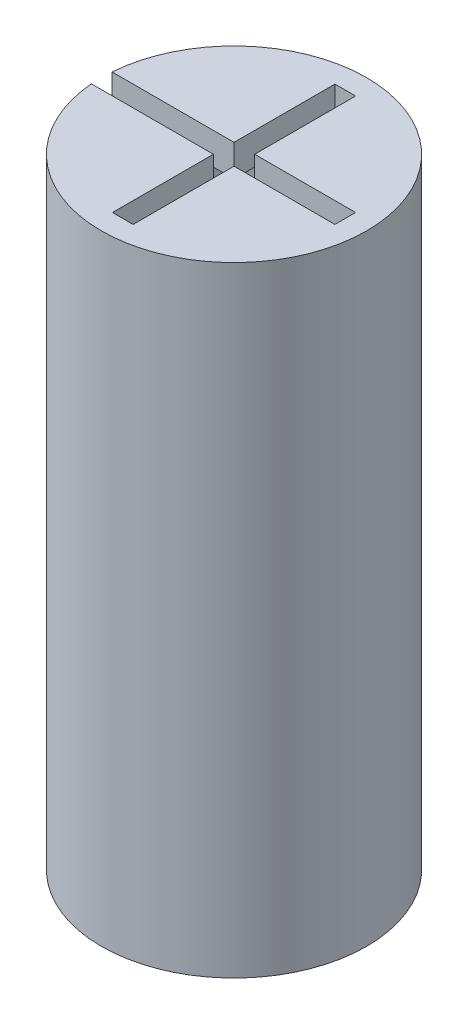
ISO-10303-21;
HEADER;
FILE_DESCRIPTION(('STEP AP214'),'2;1');
FILE_NAME('part.step','',(''),(''),'','','');
FILE_SCHEMA(('AUTOMOTIVE_DESIGN { 1 0 10303 214 1 1 1 1 }'));
ENDSEC;
DATA;
#1=APPLICATION_CONTEXT('core data for automotive mechanical design processes');
#2=APPLICATION_PROTOCOL_DEFINITION('international standard','automotive_design',2000,#1);
#3=PRODUCT_CONTEXT('',#1,'mechanical');
#4=PRODUCT('Part','Part','',(#3));
#5=PRODUCT_RELATED_PRODUCT_CATEGORY('part','',(#4));
#6=PRODUCT_DEFINITION_FORMATION('','',#4);
#7=PRODUCT_DEFINITION_CONTEXT('part definition',#1,'design');
#8=PRODUCT_DEFINITION('design','',#6,#7);
#9=PRODUCT_DEFINITION_SHAPE('','',#8);
#10=(LENGTH_UNIT() NAMED_UNIT(*) SI_UNIT(.MILLI.,.METRE.));
#11=(NAMED_UNIT(*) PLANE_ANGLE_UNIT() SI_UNIT($,.RADIAN.));
#12=(NAMED_UNIT(*) SI_UNIT($,.STERADIAN.) SOLID_ANGLE_UNIT());
#13=UNCERTAINTY_MEASURE_WITH_UNIT(LENGTH_MEASURE(1.E-05),#10,'distance_accuracy_value','');
#14=(GEOMETRIC_REPRESENTATION_CONTEXT(3) GLOBAL_UNCERTAINTY_ASSIGNED_CONTEXT((#13)) GLOBAL_UNIT_ASSIGNED_CONTEXT((#10,
#11,#12)) REPRESENTATION_CONTEXT('',''));
#15=CARTESIAN_POINT('',(0.,0.,0.));
#16=DIRECTION('',(0.,0.,1.));
#17=DIRECTION('',(1.,0.,0.));
#18=AXIS2_PLACEMENT_3D('',#15,#16,#17);
#19=CARTESIAN_POINT('',(0.,0.,0.));
#20=DIRECTION('',(0.,-1.,0.));
#21=DIRECTION('',(0.,0.,-1.));
#22=AXIS2_PLACEMENT_3D('',#19,#20,#21);
#23=CYLINDRICAL_SURFACE('',#22,6.35);
#24=CARTESIAN_POINT('',(0.,21.,0.));
#25=DIRECTION('',(0.,-1.,0.));
#26=DIRECTION('',(0.,0.,-1.));
#27=AXIS2_PLACEMENT_3D('',#24,#25,#26);
#28=CIRCLE('',#27,6.35);
#29=CARTESIAN_POINT('',(-6.3166446789415,21.,-0.65));
#30=VERTEX_POINT('',#29);
#31=CARTESIAN_POINT('',(-0.649999999999999,21.,-6.3166446789415));
#32=VERTEX_POINT('',#31);
#33=EDGE_CURVE('E392',#30,#32,#28,.T.);
#34=ORIENTED_EDGE('',*,*,#33,.F.);
#35=DIRECTION('',(0.,-1.,0.));
#36=VECTOR('',#35,1.);
#37=CARTESIAN_POINT('',(-6.3166446789415,0.,-0.65));
#38=LINE('',#37,#36);
#39=CARTESIAN_POINT('',(-6.3166446789415,0.,-0.65));
#40=VERTEX_POINT('',#39);
#41=EDGE_CURVE('E386',#30,#40,#38,.T.);
#42=ORIENTED_EDGE('',*,*,#41,.T.);
#43=CARTESIAN_POINT('',(0.,0.,0.));
#44=DIRECTION('',(0.,-1.,0.));
#45=DIRECTION('',(0.,0.,-1.));
#46=AXIS2_PLACEMENT_3D('',#43,#44,#45);
#47=CIRCLE('',#46,6.35);
#48=CARTESIAN_POINT('',(-0.649999999999999,0.,-6.3166446789415));
#49=VERTEX_POINT('',#48);
#50=EDGE_CURVE('E413',#40,#49,#47,.T.);
#51=ORIENTED_EDGE('',*,*,#50,.T.);
#52=DIRECTION('',(0.,-1.,0.));
#53=VECTOR('',#52,1.);
#54=CARTESIAN_POINT('',(-0.649999999999999,0.,-6.3166446789415));
#55=LINE('',#54,#53);
#56=EDGE_CURVE('E374',#49,#32,#55,.F.);
#57=ORIENTED_EDGE('',*,*,#56,.T.);
#58=EDGE_LOOP('',(#34,#42,#51,#57));
#59=FACE_BOUND('',#58,.T.);
#60=ADVANCED_FACE('F37',(#59),#23,.F.);
#61=CARTESIAN_POINT('',(0.65,21.,-6.3166446789415));
#62=VERTEX_POINT('',#61);
#63=CARTESIAN_POINT('',(6.3166446789415,21.,-0.65));
#64=VERTEX_POINT('',#63);
#65=EDGE_CURVE('E393',#62,#64,#28,.T.);
#66=ORIENTED_EDGE('',*,*,#65,.F.);
#67=DIRECTION('',(0.,-1.,0.));
#68=VECTOR('',#67,1.);
#69=CARTESIAN_POINT('',(0.65,0.,-6.3166446789415));
#70=LINE('',#69,#68);
#71=CARTESIAN_POINT('',(0.65,0.,-6.3166446789415));
#72=VERTEX_POINT('',#71);
#73=EDGE_CURVE('E362',#62,#72,#70,.T.);
#74=ORIENTED_EDGE('',*,*,#73,.T.);
#75=CARTESIAN_POINT('',(6.3166446789415,0.,-0.65));
#76=VERTEX_POINT('',#75);
#77=EDGE_CURVE('E414',#72,#76,#47,.T.);
#78=ORIENTED_EDGE('',*,*,#77,.T.);
#79=DIRECTION('',(0.,-1.,0.));
#80=VECTOR('',#79,1.);
#81=CARTESIAN_POINT('',(6.3166446789415,0.,-0.65));
#82=LINE('',#81,#80);
#83=EDGE_CURVE('E350',#76,#64,#82,.F.);
#84=ORIENTED_EDGE('',*,*,#83,.T.);
#85=EDGE_LOOP('',(#66,#74,#78,#84));
#86=FACE_BOUND('',#85,.T.);
#87=ADVANCED_FACE('F528',(#86),#23,.F.);
#88=CARTESIAN_POINT('',(6.3166446789415,21.,0.65));
#89=VERTEX_POINT('',#88);
#90=CARTESIAN_POINT('',(0.65,21.,6.3166446789415));
#91=VERTEX_POINT('',#90);
#92=EDGE_CURVE('E397',#89,#91,#28,.T.);
#93=ORIENTED_EDGE('',*,*,#92,.F.);
#94=DIRECTION('',(0.,-1.,0.));
#95=VECTOR('',#94,1.);
#96=CARTESIAN_POINT('',(6.3166446789415,0.,0.65));
#97=LINE('',#96,#95);
#98=CARTESIAN_POINT('',(6.3166446789415,0.,0.65));
#99=VERTEX_POINT('',#98);
#100=EDGE_CURVE('E338',#89,#99,#97,.T.);
#101=ORIENTED_EDGE('',*,*,#100,.T.);
#102=CARTESIAN_POINT('',(0.65,0.,6.3166446789415));
#103=VERTEX_POINT('',#102);
#104=EDGE_CURVE('E418',#99,#103,#47,.T.);
#105=ORIENTED_EDGE('',*,*,#104,.T.);
#106=DIRECTION('',(0.,-1.,0.));
#107=VECTOR('',#106,1.);
#108=CARTESIAN_POINT('',(0.65,0.,6.3166446789415));
#109=LINE('',#108,#107);
#110=EDGE_CURVE('E326',#103,#91,#109,.F.);
#111=ORIENTED_EDGE('',*,*,#110,.T.);
#112=EDGE_LOOP('',(#93,#101,#105,#111));
#113=FACE_BOUND('',#112,.T.);
#114=ADVANCED_FACE('F460',(#113),#23,.F.);
#115=CARTESIAN_POINT('',(-4.35,37.,0.));
#116=DIRECTION('',(0.,1.,0.));
#117=DIRECTION('',(0.,0.,1.));
#118=AXIS2_PLACEMENT_3D('',#115,#116,#117);
#119=PLANE('',#118);
#120=DIRECTION('',(0.,0.,1.));
#121=VECTOR('',#120,1.);
#122=CARTESIAN_POINT('',(-0.649999999999999,37.,0.));
#123=LINE('',#122,#121);
#124=CARTESIAN_POINT('',(-0.649999999999999,37.,-4.30116263352131));
#125=VERTEX_POINT('',#124);
#126=CARTESIAN_POINT('',(-0.649999999999999,37.,-0.650000000000001));
#127=VERTEX_POINT('',#126);
#128=EDGE_CURVE('E371',#125,#127,#123,.T.);
#129=ORIENTED_EDGE('',*,*,#128,.T.);
#130=DIRECTION('',(-1.,0.,0.));
#131=VECTOR('',#130,1.);
#132=CARTESIAN_POINT('',(-4.35,37.,-0.65));
#133=LINE('',#132,#131);
#134=CARTESIAN_POINT('',(-4.30116263352131,37.,-0.65));
#135=VERTEX_POINT('',#134);
#136=EDGE_CURVE('E383',#127,#135,#133,.T.);
#137=ORIENTED_EDGE('',*,*,#136,.T.);
#138=CARTESIAN_POINT('',(0.,37.,0.));
#139=DIRECTION('',(0.,-1.,0.));
#140=DIRECTION('',(0.,0.,-1.));
#141=AXIS2_PLACEMENT_3D('',#138,#139,#140);
#142=CIRCLE('',#141,4.35);
#143=EDGE_CURVE('E401',#135,#125,#142,.T.);
#144=ORIENTED_EDGE('',*,*,#143,.T.);
#145=EDGE_LOOP('',(#129,#137,#144));
#146=FACE_BOUND('',#145,.T.);
#147=ADVANCED_FACE('F499',(#146),#119,.F.);
#148=DIRECTION('',(-1.,0.,0.));
#149=VECTOR('',#148,1.);
#150=CARTESIAN_POINT('',(-4.35,37.,-0.649999999999999));
#151=LINE('',#150,#149);
#152=CARTESIAN_POINT('',(4.30116263352131,37.,-0.65));
#153=VERTEX_POINT('',#152);
#154=CARTESIAN_POINT('',(0.65,37.,-0.65));
#155=VERTEX_POINT('',#154);
#156=EDGE_CURVE('E347',#153,#155,#151,.T.);
#157=ORIENTED_EDGE('',*,*,#156,.T.);
#158=DIRECTION('',(0.,0.,-1.));
#159=VECTOR('',#158,1.);
#160=CARTESIAN_POINT('',(0.65,37.,0.));
#161=LINE('',#160,#159);
#162=CARTESIAN_POINT('',(0.65,37.,-4.30116263352131));
#163=VERTEX_POINT('',#162);
#164=EDGE_CURVE('E359',#155,#163,#161,.T.);
#165=ORIENTED_EDGE('',*,*,#164,.T.);
#166=EDGE_CURVE('E403',#163,#153,#142,.T.);
#167=ORIENTED_EDGE('',*,*,#166,.T.);
#168=EDGE_LOOP('',(#157,#165,#167));
#169=FACE_BOUND('',#168,.T.);
#170=ADVANCED_FACE('F544',(#169),#119,.F.);
#171=DIRECTION('',(0.,0.,-1.));
#172=VECTOR('',#171,1.);
#173=CARTESIAN_POINT('',(0.65,37.,0.));
#174=LINE('',#173,#172);
#175=CARTESIAN_POINT('',(0.65,37.,4.30116263352131));
#176=VERTEX_POINT('',#175);
#177=CARTESIAN_POINT('',(0.65,37.,0.65));
#178=VERTEX_POINT('',#177);
#179=EDGE_CURVE('E323',#176,#178,#174,.T.);
#180=ORIENTED_EDGE('',*,*,#179,.T.);
#181=DIRECTION('',(1.,0.,0.));
#182=VECTOR('',#181,1.);
#183=CARTESIAN_POINT('',(-4.35,37.,0.65));
#184=LINE('',#183,#182);
#185=CARTESIAN_POINT('',(4.30116263352131,37.,0.65));
#186=VERTEX_POINT('',#185);
#187=EDGE_CURVE('E335',#178,#186,#184,.T.);
#188=ORIENTED_EDGE('',*,*,#187,.T.);
#189=EDGE_CURVE('E407',#186,#176,#142,.T.);
#190=ORIENTED_EDGE('',*,*,#189,.T.);
#191=EDGE_LOOP('',(#180,#188,#190));
#192=FACE_BOUND('',#191,.T.);
#193=ADVANCED_FACE('F507',(#192),#119,.F.);
#194=CARTESIAN_POINT('',(0.,0.,0.));
#195=DIRECTION('',(0.,-1.,0.));
#196=DIRECTION('',(0.,0.,-1.));
#197=AXIS2_PLACEMENT_3D('',#194,#195,#196);
#198=CYLINDRICAL_SURFACE('',#197,4.35);
#199=ORIENTED_EDGE('',*,*,#143,.F.);
#200=DIRECTION('',(0.,-1.,0.));
#201=VECTOR('',#200,1.);
#202=CARTESIAN_POINT('',(-4.30116263352131,0.,-0.65));
#203=LINE('',#202,#201);
#204=CARTESIAN_POINT('',(-4.30116263352131,21.,-0.65));
#205=VERTEX_POINT('',#204);
#206=EDGE_CURVE('E380',#135,#205,#203,.T.);
#207=ORIENTED_EDGE('',*,*,#206,.T.);
#208=CARTESIAN_POINT('',(0.,21.,0.));
#209=DIRECTION('',(0.,-1.,0.));
#210=DIRECTION('',(0.,0.,-1.));
#211=AXIS2_PLACEMENT_3D('',#208,#209,#210);
#212=CIRCLE('',#211,4.35);
#213=CARTESIAN_POINT('',(-0.649999999999999,21.,-4.30116263352131));
#214=VERTEX_POINT('',#213);
#215=EDGE_CURVE('E396',#205,#214,#212,.T.);
#216=ORIENTED_EDGE('',*,*,#215,.T.);
#217=DIRECTION('',(0.,-1.,0.));
#218=VECTOR('',#217,1.);
#219=CARTESIAN_POINT('',(-0.649999999999999,0.,-4.30116263352131));
#220=LINE('',#219,#218);
#221=EDGE_CURVE('E368',#214,#125,#220,.F.);
#222=ORIENTED_EDGE('',*,*,#221,.T.);
#223=EDGE_LOOP('',(#199,#207,#216,#222));
#224=FACE_BOUND('',#223,.T.);
#225=ADVANCED_FACE('F496',(#224),#198,.F.);
#226=ORIENTED_EDGE('',*,*,#166,.F.);
#227=DIRECTION('',(0.,-1.,0.));
#228=VECTOR('',#227,1.);
#229=CARTESIAN_POINT('',(0.65,0.,-4.30116263352131));
#230=LINE('',#229,#228);
#231=CARTESIAN_POINT('',(0.65,21.,-4.30116263352131));
#232=VERTEX_POINT('',#231);
#233=EDGE_CURVE('E356',#163,#232,#230,.T.);
#234=ORIENTED_EDGE('',*,*,#233,.T.);
#235=CARTESIAN_POINT('',(4.30116263352131,21.,-0.65));
#236=VERTEX_POINT('',#235);
#237=EDGE_CURVE('E398',#232,#236,#212,.T.);
#238=ORIENTED_EDGE('',*,*,#237,.T.);
#239=DIRECTION('',(0.,-1.,0.));
#240=VECTOR('',#239,1.);
#241=CARTESIAN_POINT('',(4.30116263352131,0.,-0.65));
#242=LINE('',#241,#240);
#243=EDGE_CURVE('E344',#236,#153,#242,.F.);
#244=ORIENTED_EDGE('',*,*,#243,.T.);
#245=EDGE_LOOP('',(#226,#234,#238,#244));
#246=FACE_BOUND('',#245,.T.);
#247=ADVANCED_FACE('F542',(#246),#198,.F.);
#248=ORIENTED_EDGE('',*,*,#189,.F.);
#249=DIRECTION('',(0.,-1.,0.));
#250=VECTOR('',#249,1.);
#251=CARTESIAN_POINT('',(4.30116263352131,0.,0.65));
#252=LINE('',#251,#250);
#253=CARTESIAN_POINT('',(4.30116263352131,21.,0.65));
#254=VERTEX_POINT('',#253);
#255=EDGE_CURVE('E332',#186,#254,#252,.T.);
#256=ORIENTED_EDGE('',*,*,#255,.T.);
#257=CARTESIAN_POINT('',(0.65,21.,4.30116263352131));
#258=VERTEX_POINT('',#257);
#259=EDGE_CURVE('E402',#254,#258,#212,.T.);
#260=ORIENTED_EDGE('',*,*,#259,.T.);
#261=DIRECTION('',(0.,-1.,0.));
#262=VECTOR('',#261,1.);
#263=CARTESIAN_POINT('',(0.65,0.,4.30116263352131));
#264=LINE('',#263,#262);
#265=EDGE_CURVE('E320',#258,#176,#264,.F.);
#266=ORIENTED_EDGE('',*,*,#265,.T.);
#267=EDGE_LOOP('',(#248,#256,#260,#266));
#268=FACE_BOUND('',#267,.T.);
#269=ADVANCED_FACE('F509',(#268),#198,.F.);
#270=CARTESIAN_POINT('',(-4.35,21.,0.));
#271=DIRECTION('',(0.,1.,0.));
#272=DIRECTION('',(0.,0.,1.));
#273=AXIS2_PLACEMENT_3D('',#270,#271,#272);
#274=PLANE('',#273);
#275=ORIENTED_EDGE('',*,*,#215,.F.);
#276=DIRECTION('',(-1.,0.,0.));
#277=VECTOR('',#276,1.);
#278=CARTESIAN_POINT('',(-4.35,21.,-0.65));
#279=LINE('',#278,#277);
#280=EDGE_CURVE('E438',#205,#30,#279,.T.);
#281=ORIENTED_EDGE('',*,*,#280,.T.);
#282=ORIENTED_EDGE('',*,*,#33,.T.);
#283=DIRECTION('',(0.,0.,1.));
#284=VECTOR('',#283,1.);
#285=CARTESIAN_POINT('',(-0.649999999999999,21.,0.));
#286=LINE('',#285,#284);
#287=EDGE_CURVE('E435',#32,#214,#286,.T.);
#288=ORIENTED_EDGE('',*,*,#287,.T.);
#289=EDGE_LOOP('',(#275,#281,#282,#288));
#290=FACE_BOUND('',#289,.T.);
#291=ADVANCED_FACE('F471',(#290),#274,.F.);
#292=ORIENTED_EDGE('',*,*,#237,.F.);
#293=DIRECTION('',(0.,0.,-1.));
#294=VECTOR('',#293,1.);
#295=CARTESIAN_POINT('',(0.65,21.,0.));
#296=LINE('',#295,#294);
#297=EDGE_CURVE('E432',#232,#62,#296,.T.);
#298=ORIENTED_EDGE('',*,*,#297,.T.);
#299=ORIENTED_EDGE('',*,*,#65,.T.);
#300=DIRECTION('',(-1.,0.,0.));
#301=VECTOR('',#300,1.);
#302=CARTESIAN_POINT('',(-4.35,21.,-0.649999999999999));
#303=LINE('',#302,#301);
#304=EDGE_CURVE('E429',#64,#236,#303,.T.);
#305=ORIENTED_EDGE('',*,*,#304,.T.);
#306=EDGE_LOOP('',(#292,#298,#299,#305));
#307=FACE_BOUND('',#306,.T.);
#308=ADVANCED_FACE('F516',(#307),#274,.F.);
#309=ORIENTED_EDGE('',*,*,#259,.F.);
#310=DIRECTION('',(1.,0.,0.));
#311=VECTOR('',#310,1.);
#312=CARTESIAN_POINT('',(-4.35,21.,0.65));
#313=LINE('',#312,#311);
#314=EDGE_CURVE('E426',#254,#89,#313,.T.);
#315=ORIENTED_EDGE('',*,*,#314,.T.);
#316=ORIENTED_EDGE('',*,*,#92,.T.);
#317=DIRECTION('',(0.,0.,-1.));
#318=VECTOR('',#317,1.);
#319=CARTESIAN_POINT('',(0.65,21.,0.));
#320=LINE('',#319,#318);
#321=EDGE_CURVE('E423',#91,#258,#320,.T.);
#322=ORIENTED_EDGE('',*,*,#321,.T.);
#323=EDGE_LOOP('',(#309,#315,#316,#322));
#324=FACE_BOUND('',#323,.T.);
#325=ADVANCED_FACE('F514',(#324),#274,.F.);
#326=CARTESIAN_POINT('',(-0.65,21.,6.3166446789415));
#327=VERTEX_POINT('',#326);
#328=CARTESIAN_POINT('',(-6.3166446789415,21.,0.65));
#329=VERTEX_POINT('',#328);
#330=EDGE_CURVE('E463',#327,#329,#28,.T.);
#331=ORIENTED_EDGE('',*,*,#330,.F.);
#332=DIRECTION('',(0.,-1.,0.));
#333=VECTOR('',#332,1.);
#334=CARTESIAN_POINT('',(-0.649999999999999,0.,6.3166446789415));
#335=LINE('',#334,#333);
#336=CARTESIAN_POINT('',(-0.649999999999999,0.,6.3166446789415));
#337=VERTEX_POINT('',#336);
#338=EDGE_CURVE('E317',#327,#337,#335,.T.);
#339=ORIENTED_EDGE('',*,*,#338,.T.);
#340=CARTESIAN_POINT('',(-6.3166446789415,0.,0.65));
#341=VERTEX_POINT('',#340);
#342=EDGE_CURVE('E250',#337,#341,#47,.T.);
#343=ORIENTED_EDGE('',*,*,#342,.T.);
#344=DIRECTION('',(0.,-1.,0.));
#345=VECTOR('',#344,1.);
#346=CARTESIAN_POINT('',(-6.3166446789415,0.,0.65));
#347=LINE('',#346,#345);
#348=EDGE_CURVE('E302',#341,#329,#347,.F.);
#349=ORIENTED_EDGE('',*,*,#348,.T.);
#350=EDGE_LOOP('',(#331,#339,#343,#349));
#351=FACE_BOUND('',#350,.T.);
#352=ADVANCED_FACE('F39',(#351),#23,.F.);
#353=CARTESIAN_POINT('',(-6.35,0.,0.));
#354=DIRECTION('',(0.,1.,0.));
#355=DIRECTION('',(0.,0.,1.));
#356=AXIS2_PLACEMENT_3D('',#353,#354,#355);
#357=PLANE('',#356);
#358=ORIENTED_EDGE('',*,*,#50,.F.);
#359=DIRECTION('',(-1.,0.,0.));
#360=VECTOR('',#359,1.);
#361=CARTESIAN_POINT('',(-7.,0.,-0.65));
#362=LINE('',#361,#360);
#363=CARTESIAN_POINT('',(-8.32466215530696,0.,-0.65));
#364=VERTEX_POINT('',#363);
#365=EDGE_CURVE('E253',#40,#364,#362,.T.);
#366=ORIENTED_EDGE('',*,*,#365,.T.);
#367=CARTESIAN_POINT('',(0.,0.,0.));
#368=DIRECTION('',(0.,-1.,0.));
#369=DIRECTION('',(0.,0.,-1.));
#370=AXIS2_PLACEMENT_3D('',#367,#368,#369);
#371=CIRCLE('',#370,8.35);
#372=CARTESIAN_POINT('',(-8.32466215530696,0.,0.65));
#373=VERTEX_POINT('',#372);
#374=EDGE_CURVE('E410',#364,#373,#371,.T.);
#375=ORIENTED_EDGE('',*,*,#374,.T.);
#376=DIRECTION('',(1.,0.,0.));
#377=VECTOR('',#376,1.);
#378=CARTESIAN_POINT('',(-7.,0.,0.65));
#379=LINE('',#378,#377);
#380=EDGE_CURVE('E251',#373,#341,#379,.T.);
#381=ORIENTED_EDGE('',*,*,#380,.T.);
#382=ORIENTED_EDGE('',*,*,#342,.F.);
#383=DIRECTION('',(0.,0.,1.));
#384=VECTOR('',#383,1.);
#385=CARTESIAN_POINT('',(-0.649999999999999,0.,7.));
#386=LINE('',#385,#384);
#387=CARTESIAN_POINT('',(-0.649999999999999,0.,7.));
#388=VERTEX_POINT('',#387);
#389=EDGE_CURVE('E226',#337,#388,#386,.T.);
#390=ORIENTED_EDGE('',*,*,#389,.T.);
#391=DIRECTION('',(1.,0.,0.));
#392=VECTOR('',#391,1.);
#393=CARTESIAN_POINT('',(0.650000000000001,0.,7.));
#394=LINE('',#393,#392);
#395=CARTESIAN_POINT('',(0.650000000000001,0.,7.));
#396=VERTEX_POINT('',#395);
#397=EDGE_CURVE('E237',#388,#396,#394,.T.);
#398=ORIENTED_EDGE('',*,*,#397,.T.);
#399=DIRECTION('',(0.,0.,-1.));
#400=VECTOR('',#399,1.);
#401=CARTESIAN_POINT('',(0.650000000000001,0.,7.));
#402=LINE('',#401,#400);
#403=EDGE_CURVE('E243',#396,#103,#402,.T.);
#404=ORIENTED_EDGE('',*,*,#403,.T.);
#405=ORIENTED_EDGE('',*,*,#104,.F.);
#406=DIRECTION('',(1.,0.,0.));
#407=VECTOR('',#406,1.);
#408=CARTESIAN_POINT('',(7.,0.,0.65));
#409=LINE('',#408,#407);
#410=CARTESIAN_POINT('',(7.,0.,0.65));
#411=VERTEX_POINT('',#410);
#412=EDGE_CURVE('E258',#99,#411,#409,.T.);
#413=ORIENTED_EDGE('',*,*,#412,.T.);
#414=DIRECTION('',(0.,0.,-1.));
#415=VECTOR('',#414,1.);
#416=CARTESIAN_POINT('',(7.,0.,0.65));
#417=LINE('',#416,#415);
#418=CARTESIAN_POINT('',(7.,0.,-0.65));
#419=VERTEX_POINT('',#418);
#420=EDGE_CURVE('E261',#411,#419,#417,.T.);
#421=ORIENTED_EDGE('',*,*,#420,.T.);
#422=DIRECTION('',(-1.,0.,0.));
#423=VECTOR('',#422,1.);
#424=CARTESIAN_POINT('',(7.,0.,-0.65));
#425=LINE('',#424,#423);
#426=EDGE_CURVE('E264',#419,#76,#425,.T.);
#427=ORIENTED_EDGE('',*,*,#426,.T.);
#428=ORIENTED_EDGE('',*,*,#77,.F.);
#429=DIRECTION('',(0.,0.,-1.));
#430=VECTOR('',#429,1.);
#431=CARTESIAN_POINT('',(0.65,0.,-0.65));
#432=LINE('',#431,#430);
#433=CARTESIAN_POINT('',(0.650000000000001,0.,-7.));
#434=VERTEX_POINT('',#433);
#435=EDGE_CURVE('E267',#72,#434,#432,.T.);
#436=ORIENTED_EDGE('',*,*,#435,.T.);
#437=DIRECTION('',(-1.,0.,0.));
#438=VECTOR('',#437,1.);
#439=CARTESIAN_POINT('',(0.650000000000001,0.,-7.));
#440=LINE('',#439,#438);
#441=CARTESIAN_POINT('',(-0.649999999999999,0.,-7.));
#442=VERTEX_POINT('',#441);
#443=EDGE_CURVE('E270',#434,#442,#440,.T.);
#444=ORIENTED_EDGE('',*,*,#443,.T.);
#445=DIRECTION('',(0.,0.,1.));
#446=VECTOR('',#445,1.);
#447=CARTESIAN_POINT('',(-0.649999999999999,0.,-0.650000000000001));
#448=LINE('',#447,#446);
#449=EDGE_CURVE('E273',#442,#49,#448,.T.);
#450=ORIENTED_EDGE('',*,*,#449,.T.);
#451=EDGE_LOOP('',(#358,#366,#375,#381,#382,#390,#398,#404,#405,#413,#421,#427,#428,#436,#444,#450));
#452=FACE_BOUND('',#451,.T.);
#453=ADVANCED_FACE('F247',(#452),#357,.F.);
#454=CARTESIAN_POINT('',(0.,0.,0.));
#455=DIRECTION('',(0.,-1.,0.));
#456=DIRECTION('',(0.,0.,-1.));
#457=AXIS2_PLACEMENT_3D('',#454,#455,#456);
#458=CYLINDRICAL_SURFACE('',#457,8.35);
#459=ORIENTED_EDGE('',*,*,#374,.F.);
#460=DIRECTION('',(0.,-1.,0.));
#461=VECTOR('',#460,1.);
#462=CARTESIAN_POINT('',(-8.32466215530696,0.,-0.65));
#463=LINE('',#462,#461);
#464=CARTESIAN_POINT('',(-8.32466215530696,39.,-0.65));
#465=VERTEX_POINT('',#464);
#466=EDGE_CURVE('E390',#364,#465,#463,.F.);
#467=ORIENTED_EDGE('',*,*,#466,.T.);
#468=CARTESIAN_POINT('',(0.,39.,0.));
#469=DIRECTION('',(0.,-1.,0.));
#470=DIRECTION('',(0.,0.,-1.));
#471=AXIS2_PLACEMENT_3D('',#468,#469,#470);
#472=CIRCLE('',#471,8.35);
#473=CARTESIAN_POINT('',(-8.32466215530696,39.,0.65));
#474=VERTEX_POINT('',#473);
#475=EDGE_CURVE('E406',#465,#474,#472,.T.);
#476=ORIENTED_EDGE('',*,*,#475,.T.);
#477=DIRECTION('',(0.,-1.,0.));
#478=VECTOR('',#477,1.);
#479=CARTESIAN_POINT('',(-8.32466215530696,0.,0.65));
#480=LINE('',#479,#478);
#481=EDGE_CURVE('E308',#474,#373,#480,.T.);
#482=ORIENTED_EDGE('',*,*,#481,.T.);
#483=EDGE_LOOP('',(#459,#467,#476,#482));
#484=FACE_BOUND('',#483,.T.);
#485=ADVANCED_FACE('F485',(#484),#458,.T.);
#486=CARTESIAN_POINT('',(-8.35,39.,0.));
#487=DIRECTION('',(0.,-1.,0.));
#488=DIRECTION('',(0.,0.,-1.));
#489=AXIS2_PLACEMENT_3D('',#486,#487,#488);
#490=PLANE('',#489);
#491=ORIENTED_EDGE('',*,*,#475,.F.);
#492=DIRECTION('',(1.,0.,0.));
#493=VECTOR('',#492,1.);
#494=CARTESIAN_POINT('',(-8.35,39.,-0.65));
#495=LINE('',#494,#493);
#496=CARTESIAN_POINT('',(-0.649999999999999,39.,-0.650000000000001));
#497=VERTEX_POINT('',#496);
#498=EDGE_CURVE('E60',#465,#497,#495,.T.);
#499=ORIENTED_EDGE('',*,*,#498,.T.);
#500=DIRECTION('',(0.,0.,-1.));
#501=VECTOR('',#500,1.);
#502=CARTESIAN_POINT('',(-0.649999999999999,39.,0.));
#503=LINE('',#502,#501);
#504=CARTESIAN_POINT('',(-0.649999999999999,39.,-7.));
#505=VERTEX_POINT('',#504);
#506=EDGE_CURVE('E377',#497,#505,#503,.T.);
#507=ORIENTED_EDGE('',*,*,#506,.T.);
#508=DIRECTION('',(1.,0.,0.));
#509=VECTOR('',#508,1.);
#510=CARTESIAN_POINT('',(-8.35,39.,-7.));
#511=LINE('',#510,#509);
#512=CARTESIAN_POINT('',(0.650000000000001,39.,-7.));
#513=VERTEX_POINT('',#512);
#514=EDGE_CURVE('E11',#505,#513,#511,.T.);
#515=ORIENTED_EDGE('',*,*,#514,.T.);
#516=DIRECTION('',(0.,0.,1.));
#517=VECTOR('',#516,1.);
#518=CARTESIAN_POINT('',(0.65,39.,0.));
#519=LINE('',#518,#517);
#520=CARTESIAN_POINT('',(0.65,39.,-0.65));
#521=VERTEX_POINT('',#520);
#522=EDGE_CURVE('E365',#513,#521,#519,.T.);
#523=ORIENTED_EDGE('',*,*,#522,.T.);
#524=DIRECTION('',(1.,0.,0.));
#525=VECTOR('',#524,1.);
#526=CARTESIAN_POINT('',(-8.35,39.,-0.649999999999999));
#527=LINE('',#526,#525);
#528=CARTESIAN_POINT('',(7.,39.,-0.65));
#529=VERTEX_POINT('',#528);
#530=EDGE_CURVE('E353',#521,#529,#527,.T.);
#531=ORIENTED_EDGE('',*,*,#530,.T.);
#532=DIRECTION('',(0.,0.,1.));
#533=VECTOR('',#532,1.);
#534=CARTESIAN_POINT('',(7.,39.,0.));
#535=LINE('',#534,#533);
#536=CARTESIAN_POINT('',(7.,39.,0.65));
#537=VERTEX_POINT('',#536);
#538=EDGE_CURVE('E45',#529,#537,#535,.T.);
#539=ORIENTED_EDGE('',*,*,#538,.T.);
#540=DIRECTION('',(-1.,0.,0.));
#541=VECTOR('',#540,1.);
#542=CARTESIAN_POINT('',(-8.35,39.,0.649999999999999));
#543=LINE('',#542,#541);
#544=CARTESIAN_POINT('',(0.65,39.,0.65));
#545=VERTEX_POINT('',#544);
#546=EDGE_CURVE('E341',#537,#545,#543,.T.);
#547=ORIENTED_EDGE('',*,*,#546,.T.);
#548=DIRECTION('',(0.,0.,1.));
#549=VECTOR('',#548,1.);
#550=CARTESIAN_POINT('',(0.65,39.,0.));
#551=LINE('',#550,#549);
#552=CARTESIAN_POINT('',(0.650000000000001,39.,7.));
#553=VERTEX_POINT('',#552);
#554=EDGE_CURVE('E329',#545,#553,#551,.T.);
#555=ORIENTED_EDGE('',*,*,#554,.T.);
#556=DIRECTION('',(-1.,0.,0.));
#557=VECTOR('',#556,1.);
#558=CARTESIAN_POINT('',(-8.35,39.,7.));
#559=LINE('',#558,#557);
#560=CARTESIAN_POINT('',(-0.649999999999999,39.,7.));
#561=VERTEX_POINT('',#560);
#562=EDGE_CURVE('E441',#553,#561,#559,.T.);
#563=ORIENTED_EDGE('',*,*,#562,.T.);
#564=DIRECTION('',(0.,0.,-1.));
#565=VECTOR('',#564,1.);
#566=CARTESIAN_POINT('',(-0.65,39.,0.));
#567=LINE('',#566,#565);
#568=CARTESIAN_POINT('',(-0.65,39.,0.649999999999999));
#569=VERTEX_POINT('',#568);
#570=EDGE_CURVE('E230',#561,#569,#567,.T.);
#571=ORIENTED_EDGE('',*,*,#570,.T.);
#572=DIRECTION('',(-1.,0.,0.));
#573=VECTOR('',#572,1.);
#574=CARTESIAN_POINT('',(-8.35,39.,0.65));
#575=LINE('',#574,#573);
#576=EDGE_CURVE('E305',#569,#474,#575,.T.);
#577=ORIENTED_EDGE('',*,*,#576,.T.);
#578=EDGE_LOOP('',(#491,#499,#507,#515,#523,#531,#539,#547,#555,#563,#571,#577));
#579=FACE_BOUND('',#578,.T.);
#580=ADVANCED_FACE('F445',(#579),#490,.F.);
#581=DIRECTION('',(1.,0.,0.));
#582=VECTOR('',#581,1.);
#583=CARTESIAN_POINT('',(-4.35,37.,0.649999999999999));
#584=LINE('',#583,#582);
#585=CARTESIAN_POINT('',(-4.30116263352131,37.,0.649999999999999));
#586=VERTEX_POINT('',#585);
#587=CARTESIAN_POINT('',(-0.65,37.,0.649999999999999));
#588=VERTEX_POINT('',#587);
#589=EDGE_CURVE('E299',#586,#588,#584,.T.);
#590=ORIENTED_EDGE('',*,*,#589,.T.);
#591=DIRECTION('',(0.,0.,1.));
#592=VECTOR('',#591,1.);
#593=CARTESIAN_POINT('',(-0.65,37.,0.));
#594=LINE('',#593,#592);
#595=CARTESIAN_POINT('',(-0.65,37.,4.30116263352131));
#596=VERTEX_POINT('',#595);
#597=EDGE_CURVE('E314',#588,#596,#594,.T.);
#598=ORIENTED_EDGE('',*,*,#597,.T.);
#599=EDGE_CURVE('E500',#596,#586,#142,.T.);
#600=ORIENTED_EDGE('',*,*,#599,.T.);
#601=EDGE_LOOP('',(#590,#598,#600));
#602=FACE_BOUND('',#601,.T.);
#603=ADVANCED_FACE('F551',(#602),#119,.F.);
#604=ORIENTED_EDGE('',*,*,#599,.F.);
#605=DIRECTION('',(0.,-1.,0.));
#606=VECTOR('',#605,1.);
#607=CARTESIAN_POINT('',(-0.65,0.,4.30116263352131));
#608=LINE('',#607,#606);
#609=CARTESIAN_POINT('',(-0.65,21.,4.30116263352131));
#610=VERTEX_POINT('',#609);
#611=EDGE_CURVE('E311',#596,#610,#608,.T.);
#612=ORIENTED_EDGE('',*,*,#611,.T.);
#613=CARTESIAN_POINT('',(-4.30116263352131,21.,0.649999999999999));
#614=VERTEX_POINT('',#613);
#615=EDGE_CURVE('E491',#610,#614,#212,.T.);
#616=ORIENTED_EDGE('',*,*,#615,.T.);
#617=DIRECTION('',(0.,-1.,0.));
#618=VECTOR('',#617,1.);
#619=CARTESIAN_POINT('',(-4.30116263352131,0.,0.649999999999999));
#620=LINE('',#619,#618);
#621=EDGE_CURVE('E52',#614,#586,#620,.F.);
#622=ORIENTED_EDGE('',*,*,#621,.T.);
#623=EDGE_LOOP('',(#604,#612,#616,#622));
#624=FACE_BOUND('',#623,.T.);
#625=ADVANCED_FACE('F526',(#624),#198,.F.);
#626=ORIENTED_EDGE('',*,*,#615,.F.);
#627=DIRECTION('',(0.,0.,1.));
#628=VECTOR('',#627,1.);
#629=CARTESIAN_POINT('',(-0.65,21.,0.));
#630=LINE('',#629,#628);
#631=EDGE_CURVE('E420',#610,#327,#630,.T.);
#632=ORIENTED_EDGE('',*,*,#631,.T.);
#633=ORIENTED_EDGE('',*,*,#330,.T.);
#634=DIRECTION('',(1.,0.,0.));
#635=VECTOR('',#634,1.);
#636=CARTESIAN_POINT('',(-4.35,21.,0.649999999999999));
#637=LINE('',#636,#635);
#638=EDGE_CURVE('E417',#329,#614,#637,.T.);
#639=ORIENTED_EDGE('',*,*,#638,.T.);
#640=EDGE_LOOP('',(#626,#632,#633,#639));
#641=FACE_BOUND('',#640,.T.);
#642=ADVANCED_FACE('F489',(#641),#274,.F.);
#643=CARTESIAN_POINT('',(0.650000000000001,0.,-7.));
#644=DIRECTION('',(0.,0.,-1.));
#645=DIRECTION('',(-1.,0.,0.));
#646=AXIS2_PLACEMENT_3D('',#643,#644,#645);
#647=PLANE('',#646);
#648=DIRECTION('',(0.,1.,0.));
#649=VECTOR('',#648,1.);
#650=CARTESIAN_POINT('',(-0.649999999999999,0.,-7.));
#651=LINE('',#650,#649);
#652=EDGE_CURVE('E278',#442,#505,#651,.T.);
#653=ORIENTED_EDGE('',*,*,#652,.F.);
#654=ORIENTED_EDGE('',*,*,#443,.F.);
#655=DIRECTION('',(0.,1.,0.));
#656=VECTOR('',#655,1.);
#657=CARTESIAN_POINT('',(0.650000000000001,0.,-7.));
#658=LINE('',#657,#656);
#659=EDGE_CURVE('E281',#434,#513,#658,.T.);
#660=ORIENTED_EDGE('',*,*,#659,.T.);
#661=ORIENTED_EDGE('',*,*,#514,.F.);
#662=EDGE_LOOP('',(#653,#654,#660,#661));
#663=FACE_BOUND('',#662,.T.);
#664=ADVANCED_FACE('F482',(#663),#647,.F.);
#665=CARTESIAN_POINT('',(7.,0.,0.65));
#666=DIRECTION('',(1.,0.,0.));
#667=DIRECTION('',(0.,0.,-1.));
#668=AXIS2_PLACEMENT_3D('',#665,#666,#667);
#669=PLANE('',#668);
#670=DIRECTION('',(0.,1.,0.));
#671=VECTOR('',#670,1.);
#672=CARTESIAN_POINT('',(7.,0.,-0.65));
#673=LINE('',#672,#671);
#674=EDGE_CURVE('E287',#419,#529,#673,.T.);
#675=ORIENTED_EDGE('',*,*,#674,.F.);
#676=ORIENTED_EDGE('',*,*,#420,.F.);
#677=DIRECTION('',(0.,1.,0.));
#678=VECTOR('',#677,1.);
#679=CARTESIAN_POINT('',(7.,0.,0.65));
#680=LINE('',#679,#678);
#681=EDGE_CURVE('E290',#411,#537,#680,.T.);
#682=ORIENTED_EDGE('',*,*,#681,.T.);
#683=ORIENTED_EDGE('',*,*,#538,.F.);
#684=EDGE_LOOP('',(#675,#676,#682,#683));
#685=FACE_BOUND('',#684,.T.);
#686=ADVANCED_FACE('F447',(#685),#669,.F.);
#687=CARTESIAN_POINT('',(0.650000000000001,0.,7.));
#688=DIRECTION('',(0.,0.,1.));
#689=DIRECTION('',(1.,0.,0.));
#690=AXIS2_PLACEMENT_3D('',#687,#688,#689);
#691=PLANE('',#690);
#692=DIRECTION('',(0.,1.,0.));
#693=VECTOR('',#692,1.);
#694=CARTESIAN_POINT('',(0.650000000000001,0.,7.));
#695=LINE('',#694,#693);
#696=EDGE_CURVE('E233',#396,#553,#695,.T.);
#697=ORIENTED_EDGE('',*,*,#696,.F.);
#698=ORIENTED_EDGE('',*,*,#397,.F.);
#699=DIRECTION('',(0.,1.,0.));
#700=VECTOR('',#699,1.);
#701=CARTESIAN_POINT('',(-0.649999999999999,0.,7.));
#702=LINE('',#701,#700);
#703=EDGE_CURVE('E222',#388,#561,#702,.T.);
#704=ORIENTED_EDGE('',*,*,#703,.T.);
#705=ORIENTED_EDGE('',*,*,#562,.F.);
#706=EDGE_LOOP('',(#697,#698,#704,#705));
#707=FACE_BOUND('',#706,.T.);
#708=ADVANCED_FACE('F238',(#707),#691,.F.);
#709=CARTESIAN_POINT('',(-0.649999999999999,0.,-0.650000000000001));
#710=DIRECTION('',(0.,0.,-1.));
#711=DIRECTION('',(-1.,0.,0.));
#712=AXIS2_PLACEMENT_3D('',#709,#710,#711);
#713=PLANE('',#712);
#714=ORIENTED_EDGE('',*,*,#365,.F.);
#715=ORIENTED_EDGE('',*,*,#41,.F.);
#716=ORIENTED_EDGE('',*,*,#280,.F.);
#717=ORIENTED_EDGE('',*,*,#206,.F.);
#718=ORIENTED_EDGE('',*,*,#136,.F.);
#719=DIRECTION('',(0.,1.,0.));
#720=VECTOR('',#719,1.);
#721=CARTESIAN_POINT('',(-0.649999999999999,0.,-0.650000000000001));
#722=LINE('',#721,#720);
#723=EDGE_CURVE('E276',#127,#497,#722,.T.);
#724=ORIENTED_EDGE('',*,*,#723,.T.);
#725=ORIENTED_EDGE('',*,*,#498,.F.);
#726=ORIENTED_EDGE('',*,*,#466,.F.);
#727=EDGE_LOOP('',(#714,#715,#716,#717,#718,#724,#725,#726));
#728=FACE_BOUND('',#727,.T.);
#729=ADVANCED_FACE('F486',(#728),#713,.F.);
#730=CARTESIAN_POINT('',(-0.649999999999999,0.,-0.650000000000001));
#731=DIRECTION('',(-1.,0.,0.));
#732=DIRECTION('',(0.,0.,1.));
#733=AXIS2_PLACEMENT_3D('',#730,#731,#732);
#734=PLANE('',#733);
#735=ORIENTED_EDGE('',*,*,#723,.F.);
#736=ORIENTED_EDGE('',*,*,#128,.F.);
#737=ORIENTED_EDGE('',*,*,#221,.F.);
#738=ORIENTED_EDGE('',*,*,#287,.F.);
#739=ORIENTED_EDGE('',*,*,#56,.F.);
#740=ORIENTED_EDGE('',*,*,#449,.F.);
#741=ORIENTED_EDGE('',*,*,#652,.T.);
#742=ORIENTED_EDGE('',*,*,#506,.F.);
#743=EDGE_LOOP('',(#735,#736,#737,#738,#739,#740,#741,#742));
#744=FACE_BOUND('',#743,.T.);
#745=ADVANCED_FACE('F478',(#744),#734,.F.);
#746=CARTESIAN_POINT('',(0.65,0.,-0.65));
#747=DIRECTION('',(1.,0.,0.));
#748=DIRECTION('',(0.,0.,-1.));
#749=AXIS2_PLACEMENT_3D('',#746,#747,#748);
#750=PLANE('',#749);
#751=ORIENTED_EDGE('',*,*,#659,.F.);
#752=ORIENTED_EDGE('',*,*,#435,.F.);
#753=ORIENTED_EDGE('',*,*,#73,.F.);
#754=ORIENTED_EDGE('',*,*,#297,.F.);
#755=ORIENTED_EDGE('',*,*,#233,.F.);
#756=ORIENTED_EDGE('',*,*,#164,.F.);
#757=DIRECTION('',(0.,1.,0.));
#758=VECTOR('',#757,1.);
#759=CARTESIAN_POINT('',(0.65,0.,-0.65));
#760=LINE('',#759,#758);
#761=EDGE_CURVE('E284',#155,#521,#760,.T.);
#762=ORIENTED_EDGE('',*,*,#761,.T.);
#763=ORIENTED_EDGE('',*,*,#522,.F.);
#764=EDGE_LOOP('',(#751,#752,#753,#754,#755,#756,#762,#763));
#765=FACE_BOUND('',#764,.T.);
#766=ADVANCED_FACE('F539',(#765),#750,.F.);
#767=CARTESIAN_POINT('',(7.,0.,-0.65));
#768=DIRECTION('',(0.,0.,-1.));
#769=DIRECTION('',(-1.,0.,0.));
#770=AXIS2_PLACEMENT_3D('',#767,#768,#769);
#771=PLANE('',#770);
#772=ORIENTED_EDGE('',*,*,#761,.F.);
#773=ORIENTED_EDGE('',*,*,#156,.F.);
#774=ORIENTED_EDGE('',*,*,#243,.F.);
#775=ORIENTED_EDGE('',*,*,#304,.F.);
#776=ORIENTED_EDGE('',*,*,#83,.F.);
#777=ORIENTED_EDGE('',*,*,#426,.F.);
#778=ORIENTED_EDGE('',*,*,#674,.T.);
#779=ORIENTED_EDGE('',*,*,#530,.F.);
#780=EDGE_LOOP('',(#772,#773,#774,#775,#776,#777,#778,#779));
#781=FACE_BOUND('',#780,.T.);
#782=ADVANCED_FACE('F452',(#781),#771,.F.);
#783=CARTESIAN_POINT('',(7.,0.,0.65));
#784=DIRECTION('',(0.,0.,1.));
#785=DIRECTION('',(1.,0.,0.));
#786=AXIS2_PLACEMENT_3D('',#783,#784,#785);
#787=PLANE('',#786);
#788=ORIENTED_EDGE('',*,*,#681,.F.);
#789=ORIENTED_EDGE('',*,*,#412,.F.);
#790=ORIENTED_EDGE('',*,*,#100,.F.);
#791=ORIENTED_EDGE('',*,*,#314,.F.);
#792=ORIENTED_EDGE('',*,*,#255,.F.);
#793=ORIENTED_EDGE('',*,*,#187,.F.);
#794=DIRECTION('',(0.,1.,0.));
#795=VECTOR('',#794,1.);
#796=CARTESIAN_POINT('',(0.65,0.,0.65));
#797=LINE('',#796,#795);
#798=EDGE_CURVE('E293',#178,#545,#797,.T.);
#799=ORIENTED_EDGE('',*,*,#798,.T.);
#800=ORIENTED_EDGE('',*,*,#546,.F.);
#801=EDGE_LOOP('',(#788,#789,#790,#791,#792,#793,#799,#800));
#802=FACE_BOUND('',#801,.T.);
#803=ADVANCED_FACE('F457',(#802),#787,.F.);
#804=CARTESIAN_POINT('',(0.650000000000001,0.,7.));
#805=DIRECTION('',(1.,0.,0.));
#806=DIRECTION('',(0.,0.,-1.));
#807=AXIS2_PLACEMENT_3D('',#804,#805,#806);
#808=PLANE('',#807);
#809=ORIENTED_EDGE('',*,*,#798,.F.);
#810=ORIENTED_EDGE('',*,*,#179,.F.);
#811=ORIENTED_EDGE('',*,*,#265,.F.);
#812=ORIENTED_EDGE('',*,*,#321,.F.);
#813=ORIENTED_EDGE('',*,*,#110,.F.);
#814=ORIENTED_EDGE('',*,*,#403,.F.);
#815=ORIENTED_EDGE('',*,*,#696,.T.);
#816=ORIENTED_EDGE('',*,*,#554,.F.);
#817=EDGE_LOOP('',(#809,#810,#811,#812,#813,#814,#815,#816));
#818=FACE_BOUND('',#817,.T.);
#819=ADVANCED_FACE('F513',(#818),#808,.F.);
#820=CARTESIAN_POINT('',(-0.649999999999999,0.,7.));
#821=DIRECTION('',(-1.,0.,0.));
#822=DIRECTION('',(0.,0.,1.));
#823=AXIS2_PLACEMENT_3D('',#820,#821,#822);
#824=PLANE('',#823);
#825=ORIENTED_EDGE('',*,*,#703,.F.);
#826=ORIENTED_EDGE('',*,*,#389,.F.);
#827=ORIENTED_EDGE('',*,*,#338,.F.);
#828=ORIENTED_EDGE('',*,*,#631,.F.);
#829=ORIENTED_EDGE('',*,*,#611,.F.);
#830=ORIENTED_EDGE('',*,*,#597,.F.);
#831=DIRECTION('',(0.,1.,0.));
#832=VECTOR('',#831,1.);
#833=CARTESIAN_POINT('',(-0.65,0.,0.649999999999999));
#834=LINE('',#833,#832);
#835=EDGE_CURVE('E234',#588,#569,#834,.T.);
#836=ORIENTED_EDGE('',*,*,#835,.T.);
#837=ORIENTED_EDGE('',*,*,#570,.F.);
#838=EDGE_LOOP('',(#825,#826,#827,#828,#829,#830,#836,#837));
#839=FACE_BOUND('',#838,.T.);
#840=ADVANCED_FACE('F224',(#839),#824,.F.);
#841=CARTESIAN_POINT('',(-0.65,0.,0.649999999999999));
#842=DIRECTION('',(0.,0.,1.));
#843=DIRECTION('',(1.,0.,0.));
#844=AXIS2_PLACEMENT_3D('',#841,#842,#843);
#845=PLANE('',#844);
#846=ORIENTED_EDGE('',*,*,#576,.F.);
#847=ORIENTED_EDGE('',*,*,#835,.F.);
#848=ORIENTED_EDGE('',*,*,#589,.F.);
#849=ORIENTED_EDGE('',*,*,#621,.F.);
#850=ORIENTED_EDGE('',*,*,#638,.F.);
#851=ORIENTED_EDGE('',*,*,#348,.F.);
#852=ORIENTED_EDGE('',*,*,#380,.F.);
#853=ORIENTED_EDGE('',*,*,#481,.F.);
#854=EDGE_LOOP('',(#846,#847,#848,#849,#850,#851,#852,#853));
#855=FACE_BOUND('',#854,.T.);
#856=ADVANCED_FACE('F643',(#855),#845,.F.);
#857=CLOSED_SHELL('',(#60,#87,#114,#147,#170,#193,#225,#247,#269,#291,#308,#325,#352,#453,#485,
#580,#603,#625,#642,#664,#686,#708,#729,#745,#766,#782,#803,#819,#840,#856));
#858=MANIFOLD_SOLID_BREP('B2',#857);
#859=ADVANCED_BREP_SHAPE_REPRESENTATION('',(#18,#858),#14);
#860=SHAPE_DEFINITION_REPRESENTATION(#9,#859);
ENDSEC;
END-ISO-10303-21;
